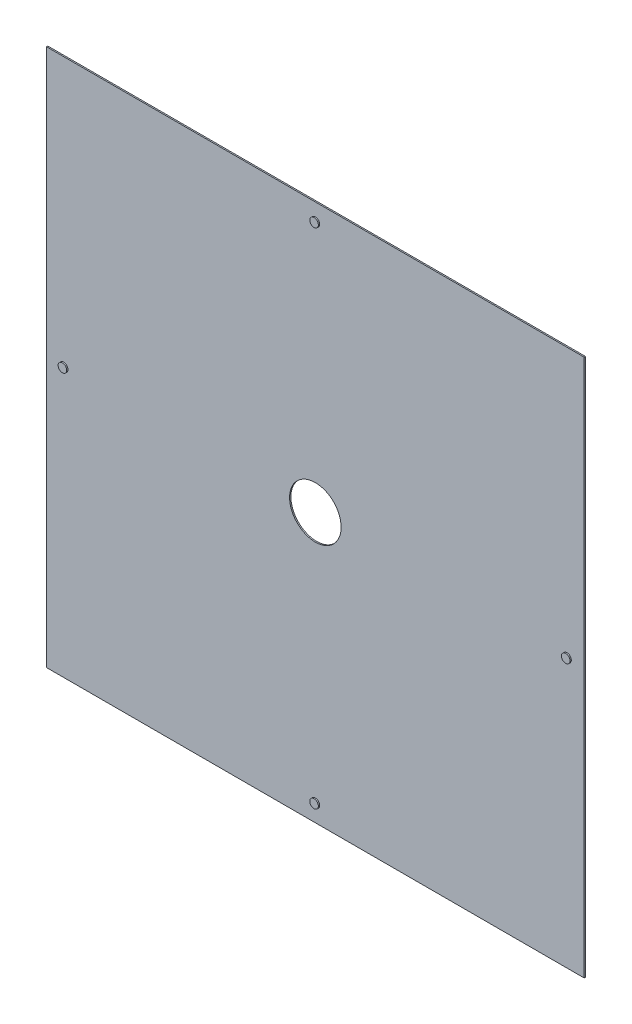
ISO-10303-21;
HEADER;
FILE_DESCRIPTION(('STEP AP214'),'2;1');
FILE_NAME('part.step','',(''),(''),'','','');
FILE_SCHEMA(('AUTOMOTIVE_DESIGN { 1 0 10303 214 1 1 1 1 }'));
ENDSEC;
DATA;
#1=APPLICATION_CONTEXT('core data for automotive mechanical design processes');
#2=APPLICATION_PROTOCOL_DEFINITION('international standard','automotive_design',2000,#1);
#3=PRODUCT_CONTEXT('',#1,'mechanical');
#4=PRODUCT('Part','Part','',(#3));
#5=PRODUCT_RELATED_PRODUCT_CATEGORY('part','',(#4));
#6=PRODUCT_DEFINITION_FORMATION('','',#4);
#7=PRODUCT_DEFINITION_CONTEXT('part definition',#1,'design');
#8=PRODUCT_DEFINITION('design','',#6,#7);
#9=PRODUCT_DEFINITION_SHAPE('','',#8);
#10=(LENGTH_UNIT() NAMED_UNIT(*) SI_UNIT(.MILLI.,.METRE.));
#11=(NAMED_UNIT(*) PLANE_ANGLE_UNIT() SI_UNIT($,.RADIAN.));
#12=(NAMED_UNIT(*) SI_UNIT($,.STERADIAN.) SOLID_ANGLE_UNIT());
#13=UNCERTAINTY_MEASURE_WITH_UNIT(LENGTH_MEASURE(1.E-05),#10,'distance_accuracy_value','');
#14=(GEOMETRIC_REPRESENTATION_CONTEXT(3) GLOBAL_UNCERTAINTY_ASSIGNED_CONTEXT((#13)) GLOBAL_UNIT_ASSIGNED_CONTEXT((#10,
#11,#12)) REPRESENTATION_CONTEXT('',''));
#15=CARTESIAN_POINT('',(0.,0.,0.));
#16=DIRECTION('',(0.,0.,1.));
#17=DIRECTION('',(1.,0.,0.));
#18=AXIS2_PLACEMENT_3D('',#15,#16,#17);
#19=CARTESIAN_POINT('',(0.,0.,1.5));
#20=DIRECTION('',(0.,0.,1.));
#21=DIRECTION('',(1.,0.,0.));
#22=AXIS2_PLACEMENT_3D('',#19,#20,#21);
#23=PLANE('',#22);
#24=CARTESIAN_POINT('',(293.,0.,1.5));
#25=DIRECTION('',(0.,0.,1.));
#26=DIRECTION('',(-1.,0.,0.));
#27=AXIS2_PLACEMENT_3D('',#24,#25,#26);
#28=CIRCLE('',#27,4.99999999999999);
#29=CARTESIAN_POINT('',(288.,0.,1.5));
#30=VERTEX_POINT('',#29);
#31=EDGE_CURVE('E139',#30,#30,#28,.T.);
#32=ORIENTED_EDGE('',*,*,#31,.F.);
#33=EDGE_LOOP('',(#32));
#34=FACE_BOUND('',#33,.T.);
#35=CARTESIAN_POINT('',(0.,-293.,1.5));
#36=DIRECTION('',(0.,0.,1.));
#37=DIRECTION('',(-1.,0.,0.));
#38=AXIS2_PLACEMENT_3D('',#35,#36,#37);
#39=CIRCLE('',#38,5.00000000000001);
#40=CARTESIAN_POINT('',(-5.00000000000006,-293.,1.5));
#41=VERTEX_POINT('',#40);
#42=EDGE_CURVE('E133',#41,#41,#39,.T.);
#43=ORIENTED_EDGE('',*,*,#42,.F.);
#44=EDGE_LOOP('',(#43));
#45=FACE_BOUND('',#44,.T.);
#46=CARTESIAN_POINT('',(-293.,0.,1.5));
#47=DIRECTION('',(0.,0.,1.));
#48=DIRECTION('',(1.,0.,0.));
#49=AXIS2_PLACEMENT_3D('',#46,#47,#48);
#50=CIRCLE('',#49,4.99999999999999);
#51=CARTESIAN_POINT('',(-288.,0.,1.5));
#52=VERTEX_POINT('',#51);
#53=EDGE_CURVE('E127',#52,#52,#50,.T.);
#54=ORIENTED_EDGE('',*,*,#53,.F.);
#55=EDGE_LOOP('',(#54));
#56=FACE_BOUND('',#55,.T.);
#57=CARTESIAN_POINT('',(0.,293.,1.5));
#58=DIRECTION('',(0.,0.,1.));
#59=DIRECTION('',(1.,0.,0.));
#60=AXIS2_PLACEMENT_3D('',#57,#58,#59);
#61=CIRCLE('',#60,5.00000000000001);
#62=CARTESIAN_POINT('',(4.99999999999995,293.,1.5));
#63=VERTEX_POINT('',#62);
#64=EDGE_CURVE('E124',#63,#63,#61,.T.);
#65=ORIENTED_EDGE('',*,*,#64,.F.);
#66=EDGE_LOOP('',(#65));
#67=FACE_BOUND('',#66,.T.);
#68=DIRECTION('',(0.,1.,0.));
#69=VECTOR('',#68,1.);
#70=CARTESIAN_POINT('',(313.,313.,1.5));
#71=LINE('',#70,#69);
#72=CARTESIAN_POINT('',(313.,-313.,1.5));
#73=VERTEX_POINT('',#72);
#74=CARTESIAN_POINT('',(313.,313.,1.5));
#75=VERTEX_POINT('',#74);
#76=EDGE_CURVE('E91',#73,#75,#71,.T.);
#77=ORIENTED_EDGE('',*,*,#76,.T.);
#78=DIRECTION('',(-1.,0.,0.));
#79=VECTOR('',#78,1.);
#80=CARTESIAN_POINT('',(-313.,313.,1.5));
#81=LINE('',#80,#79);
#82=CARTESIAN_POINT('',(-313.,313.,1.5));
#83=VERTEX_POINT('',#82);
#84=EDGE_CURVE('E86',#75,#83,#81,.T.);
#85=ORIENTED_EDGE('',*,*,#84,.T.);
#86=DIRECTION('',(0.,-1.,0.));
#87=VECTOR('',#86,1.);
#88=CARTESIAN_POINT('',(-313.,313.,1.5));
#89=LINE('',#88,#87);
#90=CARTESIAN_POINT('',(-313.,-313.,1.5));
#91=VERTEX_POINT('',#90);
#92=EDGE_CURVE('E89',#83,#91,#89,.T.);
#93=ORIENTED_EDGE('',*,*,#92,.T.);
#94=DIRECTION('',(1.,0.,0.));
#95=VECTOR('',#94,1.);
#96=CARTESIAN_POINT('',(-313.,-313.,1.5));
#97=LINE('',#96,#95);
#98=EDGE_CURVE('E56',#91,#73,#97,.T.);
#99=ORIENTED_EDGE('',*,*,#98,.T.);
#100=EDGE_LOOP('',(#77,#85,#93,#99));
#101=FACE_BOUND('',#100,.T.);
#102=CARTESIAN_POINT('',(0.,0.,1.5));
#103=DIRECTION('',(0.,0.,1.));
#104=DIRECTION('',(1.,0.,0.));
#105=AXIS2_PLACEMENT_3D('',#102,#103,#104);
#106=CIRCLE('',#105,30.);
#107=CARTESIAN_POINT('',(29.9999999999999,0.,1.5));
#108=VERTEX_POINT('',#107);
#109=EDGE_CURVE('E106',#108,#108,#106,.T.);
#110=ORIENTED_EDGE('',*,*,#109,.F.);
#111=EDGE_LOOP('',(#110));
#112=FACE_BOUND('',#111,.T.);
#113=ADVANCED_FACE('F39',(#34,#45,#56,#67,#101,#112),#23,.T.);
#114=CARTESIAN_POINT('',(0.,0.,0.));
#115=DIRECTION('',(0.,0.,1.));
#116=DIRECTION('',(1.,0.,0.));
#117=AXIS2_PLACEMENT_3D('',#114,#115,#116);
#118=PLANE('',#117);
#119=DIRECTION('',(0.,1.,0.));
#120=VECTOR('',#119,1.);
#121=CARTESIAN_POINT('',(313.,313.,0.));
#122=LINE('',#121,#120);
#123=CARTESIAN_POINT('',(313.,-313.,0.));
#124=VERTEX_POINT('',#123);
#125=CARTESIAN_POINT('',(313.,313.,0.));
#126=VERTEX_POINT('',#125);
#127=EDGE_CURVE('E103',#124,#126,#122,.T.);
#128=ORIENTED_EDGE('',*,*,#127,.F.);
#129=DIRECTION('',(1.,0.,0.));
#130=VECTOR('',#129,1.);
#131=CARTESIAN_POINT('',(-313.,-313.,0.));
#132=LINE('',#131,#130);
#133=CARTESIAN_POINT('',(-313.,-313.,0.));
#134=VERTEX_POINT('',#133);
#135=EDGE_CURVE('E79',#134,#124,#132,.T.);
#136=ORIENTED_EDGE('',*,*,#135,.F.);
#137=DIRECTION('',(0.,-1.,0.));
#138=VECTOR('',#137,1.);
#139=CARTESIAN_POINT('',(-313.,313.,0.));
#140=LINE('',#139,#138);
#141=CARTESIAN_POINT('',(-313.,313.,0.));
#142=VERTEX_POINT('',#141);
#143=EDGE_CURVE('E73',#142,#134,#140,.T.);
#144=ORIENTED_EDGE('',*,*,#143,.F.);
#145=DIRECTION('',(-1.,0.,0.));
#146=VECTOR('',#145,1.);
#147=CARTESIAN_POINT('',(-313.,313.,0.));
#148=LINE('',#147,#146);
#149=EDGE_CURVE('E95',#126,#142,#148,.T.);
#150=ORIENTED_EDGE('',*,*,#149,.F.);
#151=EDGE_LOOP('',(#128,#136,#144,#150));
#152=FACE_BOUND('',#151,.T.);
#153=CARTESIAN_POINT('',(0.,0.,0.));
#154=DIRECTION('',(0.,0.,1.));
#155=DIRECTION('',(1.,0.,0.));
#156=AXIS2_PLACEMENT_3D('',#153,#154,#155);
#157=CIRCLE('',#156,30.);
#158=CARTESIAN_POINT('',(29.9999999999999,0.,0.));
#159=VERTEX_POINT('',#158);
#160=EDGE_CURVE('E118',#159,#159,#157,.T.);
#161=ORIENTED_EDGE('',*,*,#160,.T.);
#162=EDGE_LOOP('',(#161));
#163=FACE_BOUND('',#162,.T.);
#164=ADVANCED_FACE('F114',(#152,#163),#118,.F.);
#165=CARTESIAN_POINT('',(313.,313.,1.5));
#166=DIRECTION('',(-1.,0.,0.));
#167=DIRECTION('',(0.,-1.,0.));
#168=AXIS2_PLACEMENT_3D('',#165,#166,#167);
#169=PLANE('',#168);
#170=ORIENTED_EDGE('',*,*,#127,.T.);
#171=DIRECTION('',(0.,0.,-1.));
#172=VECTOR('',#171,1.);
#173=CARTESIAN_POINT('',(313.,313.,1.5));
#174=LINE('',#173,#172);
#175=EDGE_CURVE('E11',#75,#126,#174,.T.);
#176=ORIENTED_EDGE('',*,*,#175,.F.);
#177=ORIENTED_EDGE('',*,*,#76,.F.);
#178=DIRECTION('',(0.,0.,-1.));
#179=VECTOR('',#178,1.);
#180=CARTESIAN_POINT('',(313.,-313.,1.5));
#181=LINE('',#180,#179);
#182=EDGE_CURVE('E99',#73,#124,#181,.T.);
#183=ORIENTED_EDGE('',*,*,#182,.T.);
#184=EDGE_LOOP('',(#170,#176,#177,#183));
#185=FACE_BOUND('',#184,.T.);
#186=ADVANCED_FACE('F41',(#185),#169,.F.);
#187=CARTESIAN_POINT('',(-313.,313.,1.5));
#188=DIRECTION('',(0.,-1.,0.));
#189=DIRECTION('',(0.,0.,-1.));
#190=AXIS2_PLACEMENT_3D('',#187,#188,#189);
#191=PLANE('',#190);
#192=ORIENTED_EDGE('',*,*,#149,.T.);
#193=DIRECTION('',(0.,0.,-1.));
#194=VECTOR('',#193,1.);
#195=CARTESIAN_POINT('',(-313.,313.,1.5));
#196=LINE('',#195,#194);
#197=EDGE_CURVE('E48',#83,#142,#196,.T.);
#198=ORIENTED_EDGE('',*,*,#197,.F.);
#199=ORIENTED_EDGE('',*,*,#84,.F.);
#200=ORIENTED_EDGE('',*,*,#175,.T.);
#201=EDGE_LOOP('',(#192,#198,#199,#200));
#202=FACE_BOUND('',#201,.T.);
#203=ADVANCED_FACE('F94',(#202),#191,.F.);
#204=CARTESIAN_POINT('',(-313.,313.,1.5));
#205=DIRECTION('',(1.,0.,0.));
#206=DIRECTION('',(0.,1.,0.));
#207=AXIS2_PLACEMENT_3D('',#204,#205,#206);
#208=PLANE('',#207);
#209=ORIENTED_EDGE('',*,*,#143,.T.);
#210=DIRECTION('',(0.,0.,-1.));
#211=VECTOR('',#210,1.);
#212=CARTESIAN_POINT('',(-313.,-313.,1.5));
#213=LINE('',#212,#211);
#214=EDGE_CURVE('E96',#91,#134,#213,.T.);
#215=ORIENTED_EDGE('',*,*,#214,.F.);
#216=ORIENTED_EDGE('',*,*,#92,.F.);
#217=ORIENTED_EDGE('',*,*,#197,.T.);
#218=EDGE_LOOP('',(#209,#215,#216,#217));
#219=FACE_BOUND('',#218,.T.);
#220=ADVANCED_FACE('F97',(#219),#208,.F.);
#221=CARTESIAN_POINT('',(-313.,-313.,1.5));
#222=DIRECTION('',(0.,1.,0.));
#223=DIRECTION('',(0.,0.,1.));
#224=AXIS2_PLACEMENT_3D('',#221,#222,#223);
#225=PLANE('',#224);
#226=ORIENTED_EDGE('',*,*,#135,.T.);
#227=ORIENTED_EDGE('',*,*,#182,.F.);
#228=ORIENTED_EDGE('',*,*,#98,.F.);
#229=ORIENTED_EDGE('',*,*,#214,.T.);
#230=EDGE_LOOP('',(#226,#227,#228,#229));
#231=FACE_BOUND('',#230,.T.);
#232=ADVANCED_FACE('F111',(#231),#225,.F.);
#233=CARTESIAN_POINT('',(0.,0.,1.5));
#234=DIRECTION('',(0.,0.,-1.));
#235=DIRECTION('',(-1.,0.,0.));
#236=AXIS2_PLACEMENT_3D('',#233,#234,#235);
#237=CYLINDRICAL_SURFACE('',#236,30.);
#238=ORIENTED_EDGE('',*,*,#109,.T.);
#239=EDGE_LOOP('',(#238));
#240=FACE_BOUND('',#239,.T.);
#241=ORIENTED_EDGE('',*,*,#160,.F.);
#242=EDGE_LOOP('',(#241));
#243=FACE_BOUND('',#242,.T.);
#244=ADVANCED_FACE('F162',(#240,#243),#237,.F.);
#245=CARTESIAN_POINT('',(0.,293.,3.));
#246=DIRECTION('',(0.,0.,-1.));
#247=DIRECTION('',(-1.,0.,0.));
#248=AXIS2_PLACEMENT_3D('',#245,#246,#247);
#249=CYLINDRICAL_SURFACE('',#248,5.00000000000001);
#250=CARTESIAN_POINT('',(0.,293.,3.));
#251=DIRECTION('',(0.,0.,1.));
#252=DIRECTION('',(1.,0.,0.));
#253=AXIS2_PLACEMENT_3D('',#250,#251,#252);
#254=CIRCLE('',#253,5.00000000000001);
#255=CARTESIAN_POINT('',(4.99999999999995,293.,3.));
#256=VERTEX_POINT('',#255);
#257=EDGE_CURVE('E121',#256,#256,#254,.T.);
#258=ORIENTED_EDGE('',*,*,#257,.F.);
#259=EDGE_LOOP('',(#258));
#260=FACE_BOUND('',#259,.T.);
#261=ORIENTED_EDGE('',*,*,#64,.T.);
#262=EDGE_LOOP('',(#261));
#263=FACE_BOUND('',#262,.T.);
#264=ADVANCED_FACE('F159',(#260,#263),#249,.T.);
#265=CARTESIAN_POINT('',(0.,293.,3.));
#266=DIRECTION('',(0.,0.,1.));
#267=DIRECTION('',(1.,0.,0.));
#268=AXIS2_PLACEMENT_3D('',#265,#266,#267);
#269=PLANE('',#268);
#270=ORIENTED_EDGE('',*,*,#257,.T.);
#271=EDGE_LOOP('',(#270));
#272=FACE_BOUND('',#271,.T.);
#273=ADVANCED_FACE('F161',(#272),#269,.T.);
#274=CARTESIAN_POINT('',(-293.,0.,3.));
#275=DIRECTION('',(0.,0.,-1.));
#276=DIRECTION('',(-1.,0.,0.));
#277=AXIS2_PLACEMENT_3D('',#274,#275,#276);
#278=CYLINDRICAL_SURFACE('',#277,4.99999999999999);
#279=CARTESIAN_POINT('',(-293.,0.,3.));
#280=DIRECTION('',(0.,0.,1.));
#281=DIRECTION('',(1.,0.,0.));
#282=AXIS2_PLACEMENT_3D('',#279,#280,#281);
#283=CIRCLE('',#282,4.99999999999999);
#284=CARTESIAN_POINT('',(-288.,0.,3.));
#285=VERTEX_POINT('',#284);
#286=EDGE_CURVE('E130',#285,#285,#283,.T.);
#287=ORIENTED_EDGE('',*,*,#286,.F.);
#288=EDGE_LOOP('',(#287));
#289=FACE_BOUND('',#288,.T.);
#290=ORIENTED_EDGE('',*,*,#53,.T.);
#291=EDGE_LOOP('',(#290));
#292=FACE_BOUND('',#291,.T.);
#293=ADVANCED_FACE('F169',(#289,#292),#278,.T.);
#294=CARTESIAN_POINT('',(-293.,0.,3.));
#295=DIRECTION('',(0.,0.,1.));
#296=DIRECTION('',(1.,0.,0.));
#297=AXIS2_PLACEMENT_3D('',#294,#295,#296);
#298=PLANE('',#297);
#299=ORIENTED_EDGE('',*,*,#286,.T.);
#300=EDGE_LOOP('',(#299));
#301=FACE_BOUND('',#300,.T.);
#302=ADVANCED_FACE('F222',(#301),#298,.T.);
#303=CARTESIAN_POINT('',(0.,-293.,3.));
#304=DIRECTION('',(0.,0.,-1.));
#305=DIRECTION('',(-1.,0.,0.));
#306=AXIS2_PLACEMENT_3D('',#303,#304,#305);
#307=CYLINDRICAL_SURFACE('',#306,5.00000000000001);
#308=CARTESIAN_POINT('',(0.,-293.,3.));
#309=DIRECTION('',(0.,0.,1.));
#310=DIRECTION('',(-1.,0.,0.));
#311=AXIS2_PLACEMENT_3D('',#308,#309,#310);
#312=CIRCLE('',#311,5.00000000000001);
#313=CARTESIAN_POINT('',(-5.00000000000006,-293.,3.));
#314=VERTEX_POINT('',#313);
#315=EDGE_CURVE('E136',#314,#314,#312,.T.);
#316=ORIENTED_EDGE('',*,*,#315,.F.);
#317=EDGE_LOOP('',(#316));
#318=FACE_BOUND('',#317,.T.);
#319=ORIENTED_EDGE('',*,*,#42,.T.);
#320=EDGE_LOOP('',(#319));
#321=FACE_BOUND('',#320,.T.);
#322=ADVANCED_FACE('F233',(#318,#321),#307,.T.);
#323=CARTESIAN_POINT('',(0.,-293.,3.));
#324=DIRECTION('',(0.,0.,-1.));
#325=DIRECTION('',(-1.,0.,0.));
#326=AXIS2_PLACEMENT_3D('',#323,#324,#325);
#327=PLANE('',#326);
#328=ORIENTED_EDGE('',*,*,#315,.T.);
#329=EDGE_LOOP('',(#328));
#330=FACE_BOUND('',#329,.T.);
#331=ADVANCED_FACE('F243',(#330),#327,.F.);
#332=CARTESIAN_POINT('',(293.,0.,3.));
#333=DIRECTION('',(0.,0.,-1.));
#334=DIRECTION('',(-1.,0.,0.));
#335=AXIS2_PLACEMENT_3D('',#332,#333,#334);
#336=CYLINDRICAL_SURFACE('',#335,4.99999999999999);
#337=CARTESIAN_POINT('',(293.,0.,3.));
#338=DIRECTION('',(0.,0.,1.));
#339=DIRECTION('',(-1.,0.,0.));
#340=AXIS2_PLACEMENT_3D('',#337,#338,#339);
#341=CIRCLE('',#340,4.99999999999999);
#342=CARTESIAN_POINT('',(288.,0.,3.));
#343=VERTEX_POINT('',#342);
#344=EDGE_CURVE('E142',#343,#343,#341,.T.);
#345=ORIENTED_EDGE('',*,*,#344,.F.);
#346=EDGE_LOOP('',(#345));
#347=FACE_BOUND('',#346,.T.);
#348=ORIENTED_EDGE('',*,*,#31,.T.);
#349=EDGE_LOOP('',(#348));
#350=FACE_BOUND('',#349,.T.);
#351=ADVANCED_FACE('F148',(#347,#350),#336,.T.);
#352=CARTESIAN_POINT('',(293.,0.,3.));
#353=DIRECTION('',(0.,0.,-1.));
#354=DIRECTION('',(-1.,0.,0.));
#355=AXIS2_PLACEMENT_3D('',#352,#353,#354);
#356=PLANE('',#355);
#357=ORIENTED_EDGE('',*,*,#344,.T.);
#358=EDGE_LOOP('',(#357));
#359=FACE_BOUND('',#358,.T.);
#360=ADVANCED_FACE('F264',(#359),#356,.F.);
#361=CLOSED_SHELL('',(#113,#164,#186,#203,#220,#232,#244,#264,#273,#293,#302,#322,#331,#351,#360));
#362=MANIFOLD_SOLID_BREP('B2',#361);
#363=ADVANCED_BREP_SHAPE_REPRESENTATION('',(#18,#362),#14);
#364=SHAPE_DEFINITION_REPRESENTATION(#9,#363);
ENDSEC;
END-ISO-10303-21;
